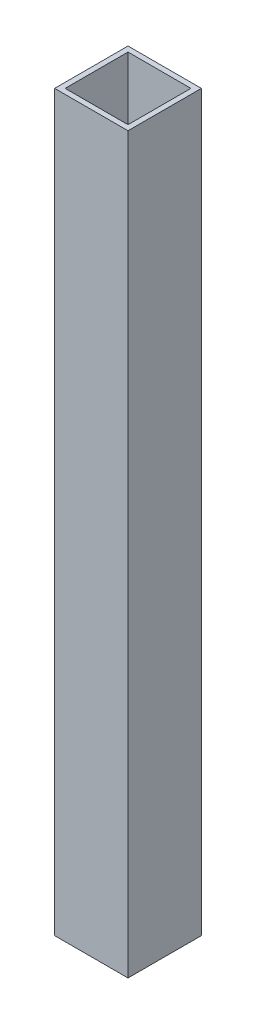
ISO-10303-21;
HEADER;
FILE_DESCRIPTION(('STEP AP214'),'2;1');
FILE_NAME('part.step','',(''),(''),'','','');
FILE_SCHEMA(('AUTOMOTIVE_DESIGN { 1 0 10303 214 1 1 1 1 }'));
ENDSEC;
DATA;
#1=APPLICATION_CONTEXT('core data for automotive mechanical design processes');
#2=APPLICATION_PROTOCOL_DEFINITION('international standard','automotive_design',2000,#1);
#3=PRODUCT_CONTEXT('',#1,'mechanical');
#4=PRODUCT('Part','Part','',(#3));
#5=PRODUCT_RELATED_PRODUCT_CATEGORY('part','',(#4));
#6=PRODUCT_DEFINITION_FORMATION('','',#4);
#7=PRODUCT_DEFINITION_CONTEXT('part definition',#1,'design');
#8=PRODUCT_DEFINITION('design','',#6,#7);
#9=PRODUCT_DEFINITION_SHAPE('','',#8);
#10=(LENGTH_UNIT() NAMED_UNIT(*) SI_UNIT(.MILLI.,.METRE.));
#11=(NAMED_UNIT(*) PLANE_ANGLE_UNIT() SI_UNIT($,.RADIAN.));
#12=(NAMED_UNIT(*) SI_UNIT($,.STERADIAN.) SOLID_ANGLE_UNIT());
#13=UNCERTAINTY_MEASURE_WITH_UNIT(LENGTH_MEASURE(1.E-05),#10,'distance_accuracy_value','');
#14=(GEOMETRIC_REPRESENTATION_CONTEXT(3) GLOBAL_UNCERTAINTY_ASSIGNED_CONTEXT((#13)) GLOBAL_UNIT_ASSIGNED_CONTEXT((#10,
#11,#12)) REPRESENTATION_CONTEXT('',''));
#15=CARTESIAN_POINT('',(0.,0.,0.));
#16=DIRECTION('',(0.,0.,1.));
#17=DIRECTION('',(1.,0.,0.));
#18=AXIS2_PLACEMENT_3D('',#15,#16,#17);
#19=CARTESIAN_POINT('',(78.0961981892586,-444.5,22.225));
#20=DIRECTION('',(-1.,0.,0.));
#21=DIRECTION('',(0.,0.,1.));
#22=AXIS2_PLACEMENT_3D('',#19,#20,#21);
#23=PLANE('',#22);
#24=DIRECTION('',(0.,1.,0.));
#25=VECTOR('',#24,1.);
#26=CARTESIAN_POINT('',(78.0961981892586,-444.5,41.275));
#27=LINE('',#26,#25);
#28=CARTESIAN_POINT('',(78.0961981892586,0.,41.275));
#29=VERTEX_POINT('',#28);
#30=CARTESIAN_POINT('',(78.0961981892586,-444.5,41.275));
#31=VERTEX_POINT('',#30);
#32=EDGE_CURVE('E17',#29,#31,#27,.F.);
#33=ORIENTED_EDGE('',*,*,#32,.T.);
#34=DIRECTION('',(0.,0.,-1.));
#35=VECTOR('',#34,1.);
#36=CARTESIAN_POINT('',(78.0961981892586,-444.5,22.225));
#37=LINE('',#36,#35);
#38=CARTESIAN_POINT('',(78.0961981892586,-444.5,3.175));
#39=VERTEX_POINT('',#38);
#40=EDGE_CURVE('E120',#39,#31,#37,.F.);
#41=ORIENTED_EDGE('',*,*,#40,.F.);
#42=DIRECTION('',(0.,1.,0.));
#43=VECTOR('',#42,1.);
#44=CARTESIAN_POINT('',(78.0961981892586,-444.5,3.175));
#45=LINE('',#44,#43);
#46=CARTESIAN_POINT('',(78.0961981892586,0.,3.175));
#47=VERTEX_POINT('',#46);
#48=EDGE_CURVE('E96',#47,#39,#45,.F.);
#49=ORIENTED_EDGE('',*,*,#48,.F.);
#50=DIRECTION('',(0.,0.,-1.));
#51=VECTOR('',#50,1.);
#52=CARTESIAN_POINT('',(78.0961981892586,0.,22.225));
#53=LINE('',#52,#51);
#54=EDGE_CURVE('E103',#47,#29,#53,.F.);
#55=ORIENTED_EDGE('',*,*,#54,.T.);
#56=EDGE_LOOP('',(#33,#41,#49,#55));
#57=FACE_BOUND('',#56,.T.);
#58=ADVANCED_FACE('F14',(#57),#23,.F.);
#59=CARTESIAN_POINT('',(97.1461981892586,-444.5,41.275));
#60=DIRECTION('',(0.,0.,1.));
#61=DIRECTION('',(1.,0.,0.));
#62=AXIS2_PLACEMENT_3D('',#59,#60,#61);
#63=PLANE('',#62);
#64=DIRECTION('',(0.,1.,0.));
#65=VECTOR('',#64,1.);
#66=CARTESIAN_POINT('',(116.196198189259,-444.5,41.275));
#67=LINE('',#66,#65);
#68=CARTESIAN_POINT('',(116.196198189259,-444.5,41.275));
#69=VERTEX_POINT('',#68);
#70=CARTESIAN_POINT('',(116.196198189259,0.,41.275));
#71=VERTEX_POINT('',#70);
#72=EDGE_CURVE('E82',#69,#71,#67,.T.);
#73=ORIENTED_EDGE('',*,*,#72,.F.);
#74=DIRECTION('',(1.,0.,0.));
#75=VECTOR('',#74,1.);
#76=CARTESIAN_POINT('',(97.1461981892586,-444.5,41.275));
#77=LINE('',#76,#75);
#78=EDGE_CURVE('E124',#31,#69,#77,.T.);
#79=ORIENTED_EDGE('',*,*,#78,.F.);
#80=ORIENTED_EDGE('',*,*,#32,.F.);
#81=DIRECTION('',(1.,0.,0.));
#82=VECTOR('',#81,1.);
#83=CARTESIAN_POINT('',(97.1461981892586,0.,41.275));
#84=LINE('',#83,#82);
#85=EDGE_CURVE('E79',#29,#71,#84,.T.);
#86=ORIENTED_EDGE('',*,*,#85,.T.);
#87=EDGE_LOOP('',(#73,#79,#80,#86));
#88=FACE_BOUND('',#87,.T.);
#89=ADVANCED_FACE('F81',(#88),#63,.F.);
#90=CARTESIAN_POINT('',(116.196198189259,-444.5,22.225));
#91=DIRECTION('',(-1.,0.,0.));
#92=DIRECTION('',(0.,0.,1.));
#93=AXIS2_PLACEMENT_3D('',#90,#91,#92);
#94=PLANE('',#93);
#95=DIRECTION('',(0.,0.,-1.));
#96=VECTOR('',#95,1.);
#97=CARTESIAN_POINT('',(116.196198189259,-444.5,22.225));
#98=LINE('',#97,#96);
#99=CARTESIAN_POINT('',(116.196198189259,-444.5,3.175));
#100=VERTEX_POINT('',#99);
#101=EDGE_CURVE('E94',#69,#100,#98,.T.);
#102=ORIENTED_EDGE('',*,*,#101,.F.);
#103=ORIENTED_EDGE('',*,*,#72,.T.);
#104=DIRECTION('',(0.,0.,-1.));
#105=VECTOR('',#104,1.);
#106=CARTESIAN_POINT('',(116.196198189259,0.,22.225));
#107=LINE('',#106,#105);
#108=CARTESIAN_POINT('',(116.196198189259,0.,3.175));
#109=VERTEX_POINT('',#108);
#110=EDGE_CURVE('E87',#71,#109,#107,.T.);
#111=ORIENTED_EDGE('',*,*,#110,.T.);
#112=DIRECTION('',(0.,1.,0.));
#113=VECTOR('',#112,1.);
#114=CARTESIAN_POINT('',(116.196198189259,-444.5,3.175));
#115=LINE('',#114,#113);
#116=EDGE_CURVE('E108',#100,#109,#115,.T.);
#117=ORIENTED_EDGE('',*,*,#116,.F.);
#118=EDGE_LOOP('',(#102,#103,#111,#117));
#119=FACE_BOUND('',#118,.T.);
#120=ADVANCED_FACE('F91',(#119),#94,.T.);
#121=CARTESIAN_POINT('',(97.1461981892586,-444.5,3.175));
#122=DIRECTION('',(0.,0.,1.));
#123=DIRECTION('',(1.,0.,0.));
#124=AXIS2_PLACEMENT_3D('',#121,#122,#123);
#125=PLANE('',#124);
#126=DIRECTION('',(1.,0.,0.));
#127=VECTOR('',#126,1.);
#128=CARTESIAN_POINT('',(97.1461981892586,-444.5,3.175));
#129=LINE('',#128,#127);
#130=EDGE_CURVE('E115',#100,#39,#129,.F.);
#131=ORIENTED_EDGE('',*,*,#130,.F.);
#132=ORIENTED_EDGE('',*,*,#116,.T.);
#133=DIRECTION('',(1.,0.,0.));
#134=VECTOR('',#133,1.);
#135=CARTESIAN_POINT('',(97.1461981892586,0.,3.175));
#136=LINE('',#135,#134);
#137=EDGE_CURVE('E101',#109,#47,#136,.F.);
#138=ORIENTED_EDGE('',*,*,#137,.T.);
#139=ORIENTED_EDGE('',*,*,#48,.T.);
#140=EDGE_LOOP('',(#131,#132,#138,#139));
#141=FACE_BOUND('',#140,.T.);
#142=ADVANCED_FACE('F114',(#141),#125,.T.);
#143=CARTESIAN_POINT('',(97.1461981892586,-444.5,0.));
#144=DIRECTION('',(0.,0.,1.));
#145=DIRECTION('',(1.,0.,0.));
#146=AXIS2_PLACEMENT_3D('',#143,#144,#145);
#147=PLANE('',#146);
#148=DIRECTION('',(0.,1.,0.));
#149=VECTOR('',#148,1.);
#150=CARTESIAN_POINT('',(119.371198189259,-444.5,0.));
#151=LINE('',#150,#149);
#152=CARTESIAN_POINT('',(119.371198189259,0.,0.));
#153=VERTEX_POINT('',#152);
#154=CARTESIAN_POINT('',(119.371198189259,-444.5,0.));
#155=VERTEX_POINT('',#154);
#156=EDGE_CURVE('E121',#153,#155,#151,.F.);
#157=ORIENTED_EDGE('',*,*,#156,.T.);
#158=DIRECTION('',(1.,0.,0.));
#159=VECTOR('',#158,1.);
#160=CARTESIAN_POINT('',(97.1461981892586,-444.5,0.));
#161=LINE('',#160,#159);
#162=CARTESIAN_POINT('',(74.9211981892586,-444.5,0.));
#163=VERTEX_POINT('',#162);
#164=EDGE_CURVE('E130',#163,#155,#161,.T.);
#165=ORIENTED_EDGE('',*,*,#164,.F.);
#166=DIRECTION('',(0.,1.,0.));
#167=VECTOR('',#166,1.);
#168=CARTESIAN_POINT('',(74.9211981892586,-444.5,0.));
#169=LINE('',#168,#167);
#170=CARTESIAN_POINT('',(74.9211981892586,0.,0.));
#171=VERTEX_POINT('',#170);
#172=EDGE_CURVE('E135',#171,#163,#169,.F.);
#173=ORIENTED_EDGE('',*,*,#172,.F.);
#174=DIRECTION('',(1.,0.,0.));
#175=VECTOR('',#174,1.);
#176=CARTESIAN_POINT('',(97.1461981892586,0.,0.));
#177=LINE('',#176,#175);
#178=EDGE_CURVE('E88',#171,#153,#177,.T.);
#179=ORIENTED_EDGE('',*,*,#178,.T.);
#180=EDGE_LOOP('',(#157,#165,#173,#179));
#181=FACE_BOUND('',#180,.T.);
#182=ADVANCED_FACE('F164',(#181),#147,.F.);
#183=CARTESIAN_POINT('',(97.1461981892586,0.,22.225));
#184=DIRECTION('',(0.,-1.,0.));
#185=DIRECTION('',(0.,0.,-1.));
#186=AXIS2_PLACEMENT_3D('',#183,#184,#185);
#187=PLANE('',#186);
#188=ORIENTED_EDGE('',*,*,#137,.F.);
#189=ORIENTED_EDGE('',*,*,#110,.F.);
#190=ORIENTED_EDGE('',*,*,#85,.F.);
#191=ORIENTED_EDGE('',*,*,#54,.F.);
#192=EDGE_LOOP('',(#188,#189,#190,#191));
#193=FACE_BOUND('',#192,.T.);
#194=DIRECTION('',(1.,0.,0.));
#195=VECTOR('',#194,1.);
#196=CARTESIAN_POINT('',(97.1461981892586,0.,44.45));
#197=LINE('',#196,#195);
#198=CARTESIAN_POINT('',(119.371198189259,0.,44.45));
#199=VERTEX_POINT('',#198);
#200=CARTESIAN_POINT('',(74.9211981892586,0.,44.45));
#201=VERTEX_POINT('',#200);
#202=EDGE_CURVE('E240',#199,#201,#197,.F.);
#203=ORIENTED_EDGE('',*,*,#202,.F.);
#204=DIRECTION('',(0.,0.,1.));
#205=VECTOR('',#204,1.);
#206=CARTESIAN_POINT('',(119.371198189259,0.,22.225));
#207=LINE('',#206,#205);
#208=EDGE_CURVE('E239',#199,#153,#207,.F.);
#209=ORIENTED_EDGE('',*,*,#208,.T.);
#210=ORIENTED_EDGE('',*,*,#178,.F.);
#211=DIRECTION('',(0.,0.,1.));
#212=VECTOR('',#211,1.);
#213=CARTESIAN_POINT('',(74.9211981892586,0.,22.225));
#214=LINE('',#213,#212);
#215=EDGE_CURVE('E137',#201,#171,#214,.F.);
#216=ORIENTED_EDGE('',*,*,#215,.F.);
#217=EDGE_LOOP('',(#203,#209,#210,#216));
#218=FACE_BOUND('',#217,.T.);
#219=ADVANCED_FACE('F98',(#193,#218),#187,.F.);
#220=CARTESIAN_POINT('',(74.9211981892586,-444.5,22.225));
#221=DIRECTION('',(-1.,0.,0.));
#222=DIRECTION('',(0.,0.,1.));
#223=AXIS2_PLACEMENT_3D('',#220,#221,#222);
#224=PLANE('',#223);
#225=DIRECTION('',(0.,0.,-1.));
#226=VECTOR('',#225,1.);
#227=CARTESIAN_POINT('',(74.9211981892586,-444.5,22.225));
#228=LINE('',#227,#226);
#229=CARTESIAN_POINT('',(74.9211981892586,-444.5,44.45));
#230=VERTEX_POINT('',#229);
#231=EDGE_CURVE('E132',#230,#163,#228,.T.);
#232=ORIENTED_EDGE('',*,*,#231,.F.);
#233=DIRECTION('',(0.,1.,0.));
#234=VECTOR('',#233,1.);
#235=CARTESIAN_POINT('',(74.9211981892586,-444.5,44.45));
#236=LINE('',#235,#234);
#237=EDGE_CURVE('E245',#201,#230,#236,.F.);
#238=ORIENTED_EDGE('',*,*,#237,.F.);
#239=ORIENTED_EDGE('',*,*,#215,.T.);
#240=ORIENTED_EDGE('',*,*,#172,.T.);
#241=EDGE_LOOP('',(#232,#238,#239,#240));
#242=FACE_BOUND('',#241,.T.);
#243=ADVANCED_FACE('F158',(#242),#224,.T.);
#244=CARTESIAN_POINT('',(97.1461981892586,-444.5,22.225));
#245=DIRECTION('',(0.,-1.,0.));
#246=DIRECTION('',(0.,0.,-1.));
#247=AXIS2_PLACEMENT_3D('',#244,#245,#246);
#248=PLANE('',#247);
#249=ORIENTED_EDGE('',*,*,#101,.T.);
#250=ORIENTED_EDGE('',*,*,#130,.T.);
#251=ORIENTED_EDGE('',*,*,#40,.T.);
#252=ORIENTED_EDGE('',*,*,#78,.T.);
#253=EDGE_LOOP('',(#249,#250,#251,#252));
#254=FACE_BOUND('',#253,.T.);
#255=DIRECTION('',(0.,0.,1.));
#256=VECTOR('',#255,1.);
#257=CARTESIAN_POINT('',(119.371198189259,-444.5,22.225));
#258=LINE('',#257,#256);
#259=CARTESIAN_POINT('',(119.371198189259,-444.5,44.45));
#260=VERTEX_POINT('',#259);
#261=EDGE_CURVE('E32',#155,#260,#258,.T.);
#262=ORIENTED_EDGE('',*,*,#261,.T.);
#263=DIRECTION('',(1.,0.,0.));
#264=VECTOR('',#263,1.);
#265=CARTESIAN_POINT('',(97.1461981892586,-444.5,44.45));
#266=LINE('',#265,#264);
#267=EDGE_CURVE('E23',#230,#260,#266,.T.);
#268=ORIENTED_EDGE('',*,*,#267,.F.);
#269=ORIENTED_EDGE('',*,*,#231,.T.);
#270=ORIENTED_EDGE('',*,*,#164,.T.);
#271=EDGE_LOOP('',(#262,#268,#269,#270));
#272=FACE_BOUND('',#271,.T.);
#273=ADVANCED_FACE('F119',(#254,#272),#248,.T.);
#274=CARTESIAN_POINT('',(119.371198189259,-444.5,22.225));
#275=DIRECTION('',(-1.,0.,0.));
#276=DIRECTION('',(0.,0.,1.));
#277=AXIS2_PLACEMENT_3D('',#274,#275,#276);
#278=PLANE('',#277);
#279=DIRECTION('',(0.,1.,0.));
#280=VECTOR('',#279,1.);
#281=CARTESIAN_POINT('',(119.371198189259,-444.5,44.45));
#282=LINE('',#281,#280);
#283=EDGE_CURVE('E9',#260,#199,#282,.T.);
#284=ORIENTED_EDGE('',*,*,#283,.F.);
#285=ORIENTED_EDGE('',*,*,#261,.F.);
#286=ORIENTED_EDGE('',*,*,#156,.F.);
#287=ORIENTED_EDGE('',*,*,#208,.F.);
#288=EDGE_LOOP('',(#284,#285,#286,#287));
#289=FACE_BOUND('',#288,.T.);
#290=ADVANCED_FACE('F146',(#289),#278,.F.);
#291=CARTESIAN_POINT('',(97.1461981892586,-444.5,44.45));
#292=DIRECTION('',(0.,0.,1.));
#293=DIRECTION('',(1.,0.,0.));
#294=AXIS2_PLACEMENT_3D('',#291,#292,#293);
#295=PLANE('',#294);
#296=ORIENTED_EDGE('',*,*,#267,.T.);
#297=ORIENTED_EDGE('',*,*,#283,.T.);
#298=ORIENTED_EDGE('',*,*,#202,.T.);
#299=ORIENTED_EDGE('',*,*,#237,.T.);
#300=EDGE_LOOP('',(#296,#297,#298,#299));
#301=FACE_BOUND('',#300,.T.);
#302=ADVANCED_FACE('F144',(#301),#295,.T.);
#303=CLOSED_SHELL('',(#58,#89,#120,#142,#182,#219,#243,#273,#290,#302));
#304=MANIFOLD_SOLID_BREP('B1',#303);
#305=ADVANCED_BREP_SHAPE_REPRESENTATION('',(#18,#304),#14);
#306=SHAPE_DEFINITION_REPRESENTATION(#9,#305);
ENDSEC;
END-ISO-10303-21;
